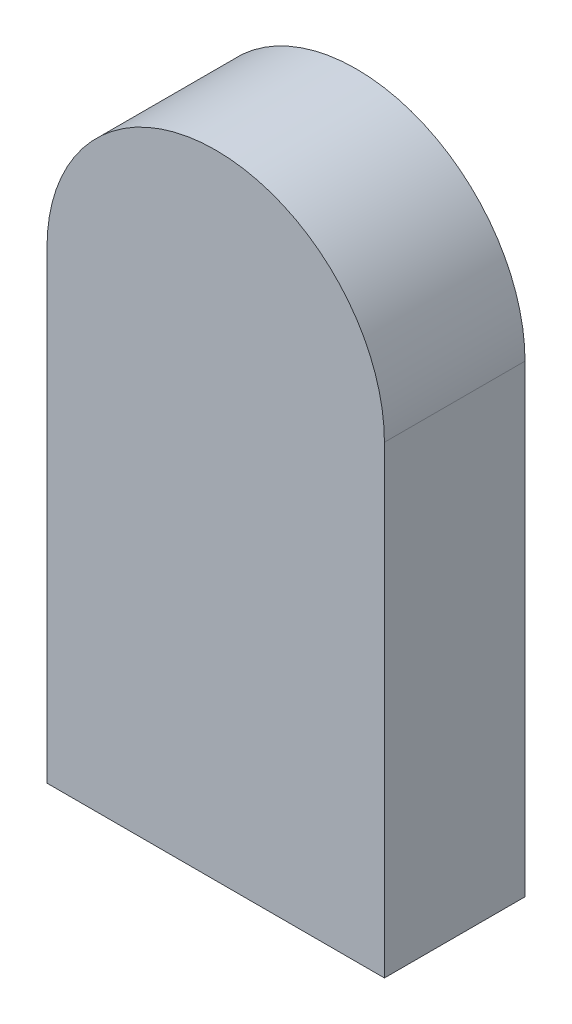
ISO-10303-21;
HEADER;
FILE_DESCRIPTION(('STEP AP214'),'2;1');
FILE_NAME('part.step','',(''),(''),'','','');
FILE_SCHEMA(('AUTOMOTIVE_DESIGN { 1 0 10303 214 1 1 1 1 }'));
ENDSEC;
DATA;
#1=APPLICATION_CONTEXT('core data for automotive mechanical design processes');
#2=APPLICATION_PROTOCOL_DEFINITION('international standard','automotive_design',2000,#1);
#3=PRODUCT_CONTEXT('',#1,'mechanical');
#4=PRODUCT('Part','Part','',(#3));
#5=PRODUCT_RELATED_PRODUCT_CATEGORY('part','',(#4));
#6=PRODUCT_DEFINITION_FORMATION('','',#4);
#7=PRODUCT_DEFINITION_CONTEXT('part definition',#1,'design');
#8=PRODUCT_DEFINITION('design','',#6,#7);
#9=PRODUCT_DEFINITION_SHAPE('','',#8);
#10=(LENGTH_UNIT() NAMED_UNIT(*) SI_UNIT(.MILLI.,.METRE.));
#11=(NAMED_UNIT(*) PLANE_ANGLE_UNIT() SI_UNIT($,.RADIAN.));
#12=(NAMED_UNIT(*) SI_UNIT($,.STERADIAN.) SOLID_ANGLE_UNIT());
#13=UNCERTAINTY_MEASURE_WITH_UNIT(LENGTH_MEASURE(1.E-05),#10,'distance_accuracy_value','');
#14=(GEOMETRIC_REPRESENTATION_CONTEXT(3) GLOBAL_UNCERTAINTY_ASSIGNED_CONTEXT((#13)) GLOBAL_UNIT_ASSIGNED_CONTEXT((#10,
#11,#12)) REPRESENTATION_CONTEXT('',''));
#15=CARTESIAN_POINT('',(0.,0.,0.));
#16=DIRECTION('',(0.,0.,1.));
#17=DIRECTION('',(1.,0.,0.));
#18=AXIS2_PLACEMENT_3D('',#15,#16,#17);
#19=CARTESIAN_POINT('',(-0.87,-4.05,0.));
#20=DIRECTION('',(0.,1.,0.));
#21=DIRECTION('',(1.,0.,0.));
#22=AXIS2_PLACEMENT_3D('',#19,#20,#21);
#23=PLANE('',#22);
#24=DIRECTION('',(1.,0.,0.));
#25=VECTOR('',#24,1.);
#26=CARTESIAN_POINT('',(-0.87,-4.05,0.));
#27=LINE('',#26,#25);
#28=CARTESIAN_POINT('',(-0.87,-4.05,0.));
#29=VERTEX_POINT('',#28);
#30=CARTESIAN_POINT('',(-0.63,-4.05,0.));
#31=VERTEX_POINT('',#30);
#32=EDGE_CURVE('E11',#29,#31,#27,.T.);
#33=ORIENTED_EDGE('',*,*,#32,.T.);
#34=DIRECTION('',(0.,0.,1.));
#35=VECTOR('',#34,1.);
#36=CARTESIAN_POINT('',(-0.63,-4.05,0.));
#37=LINE('',#36,#35);
#38=CARTESIAN_POINT('',(-0.63,-4.05,0.1));
#39=VERTEX_POINT('',#38);
#40=EDGE_CURVE('E24',#31,#39,#37,.T.);
#41=ORIENTED_EDGE('',*,*,#40,.T.);
#42=DIRECTION('',(1.,0.,0.));
#43=VECTOR('',#42,1.);
#44=CARTESIAN_POINT('',(-0.87,-4.05,0.1));
#45=LINE('',#44,#43);
#46=CARTESIAN_POINT('',(-0.87,-4.05,0.1));
#47=VERTEX_POINT('',#46);
#48=EDGE_CURVE('E87',#47,#39,#45,.T.);
#49=ORIENTED_EDGE('',*,*,#48,.F.);
#50=DIRECTION('',(0.,0.,1.));
#51=VECTOR('',#50,1.);
#52=CARTESIAN_POINT('',(-0.87,-4.05,0.));
#53=LINE('',#52,#51);
#54=EDGE_CURVE('E36',#29,#47,#53,.T.);
#55=ORIENTED_EDGE('',*,*,#54,.F.);
#56=EDGE_LOOP('',(#33,#41,#49,#55));
#57=FACE_BOUND('',#56,.T.);
#58=ADVANCED_FACE('F17',(#57),#23,.F.);
#59=CARTESIAN_POINT('',(-0.63,-4.05,0.));
#60=DIRECTION('',(-1.,0.,0.));
#61=DIRECTION('',(0.,1.,0.));
#62=AXIS2_PLACEMENT_3D('',#59,#60,#61);
#63=PLANE('',#62);
#64=DIRECTION('',(0.,1.,0.));
#65=VECTOR('',#64,1.);
#66=CARTESIAN_POINT('',(-0.63,-4.05,0.));
#67=LINE('',#66,#65);
#68=CARTESIAN_POINT('',(-0.63,-3.72,0.));
#69=VERTEX_POINT('',#68);
#70=EDGE_CURVE('E84',#31,#69,#67,.T.);
#71=ORIENTED_EDGE('',*,*,#70,.T.);
#72=DIRECTION('',(0.,0.,1.));
#73=VECTOR('',#72,1.);
#74=CARTESIAN_POINT('',(-0.63,-3.72,0.));
#75=LINE('',#74,#73);
#76=CARTESIAN_POINT('',(-0.63,-3.72,0.1));
#77=VERTEX_POINT('',#76);
#78=EDGE_CURVE('E82',#69,#77,#75,.T.);
#79=ORIENTED_EDGE('',*,*,#78,.T.);
#80=DIRECTION('',(0.,1.,0.));
#81=VECTOR('',#80,1.);
#82=CARTESIAN_POINT('',(-0.63,-4.05,0.1));
#83=LINE('',#82,#81);
#84=EDGE_CURVE('E72',#39,#77,#83,.T.);
#85=ORIENTED_EDGE('',*,*,#84,.F.);
#86=ORIENTED_EDGE('',*,*,#40,.F.);
#87=EDGE_LOOP('',(#71,#79,#85,#86));
#88=FACE_BOUND('',#87,.T.);
#89=ADVANCED_FACE('F89',(#88),#63,.F.);
#90=CARTESIAN_POINT('',(-0.75,-3.72,0.));
#91=DIRECTION('',(0.,0.,-1.));
#92=DIRECTION('',(1.,0.,0.));
#93=AXIS2_PLACEMENT_3D('',#90,#91,#92);
#94=CYLINDRICAL_SURFACE('',#93,0.12);
#95=CARTESIAN_POINT('',(-0.75,-3.72,0.));
#96=DIRECTION('',(0.,0.,1.));
#97=DIRECTION('',(1.,0.,0.));
#98=AXIS2_PLACEMENT_3D('',#95,#96,#97);
#99=CIRCLE('',#98,0.12);
#100=CARTESIAN_POINT('',(-0.87,-3.72,0.));
#101=VERTEX_POINT('',#100);
#102=EDGE_CURVE('E62',#69,#101,#99,.T.);
#103=ORIENTED_EDGE('',*,*,#102,.T.);
#104=DIRECTION('',(0.,0.,1.));
#105=VECTOR('',#104,1.);
#106=CARTESIAN_POINT('',(-0.87,-3.72,0.));
#107=LINE('',#106,#105);
#108=CARTESIAN_POINT('',(-0.87,-3.72,0.1));
#109=VERTEX_POINT('',#108);
#110=EDGE_CURVE('E57',#101,#109,#107,.T.);
#111=ORIENTED_EDGE('',*,*,#110,.T.);
#112=CARTESIAN_POINT('',(-0.75,-3.72,0.1));
#113=DIRECTION('',(0.,0.,1.));
#114=DIRECTION('',(1.,0.,0.));
#115=AXIS2_PLACEMENT_3D('',#112,#113,#114);
#116=CIRCLE('',#115,0.12);
#117=EDGE_CURVE('E60',#77,#109,#116,.T.);
#118=ORIENTED_EDGE('',*,*,#117,.F.);
#119=ORIENTED_EDGE('',*,*,#78,.F.);
#120=EDGE_LOOP('',(#103,#111,#118,#119));
#121=FACE_BOUND('',#120,.T.);
#122=ADVANCED_FACE('F59',(#121),#94,.T.);
#123=CARTESIAN_POINT('',(-0.87,-4.05,0.));
#124=DIRECTION('',(-1.,0.,0.));
#125=DIRECTION('',(0.,1.,0.));
#126=AXIS2_PLACEMENT_3D('',#123,#124,#125);
#127=PLANE('',#126);
#128=ORIENTED_EDGE('',*,*,#54,.T.);
#129=DIRECTION('',(0.,1.,0.));
#130=VECTOR('',#129,1.);
#131=CARTESIAN_POINT('',(-0.87,-4.05,0.1));
#132=LINE('',#131,#130);
#133=EDGE_CURVE('E71',#47,#109,#132,.T.);
#134=ORIENTED_EDGE('',*,*,#133,.T.);
#135=ORIENTED_EDGE('',*,*,#110,.F.);
#136=DIRECTION('',(0.,1.,0.));
#137=VECTOR('',#136,1.);
#138=CARTESIAN_POINT('',(-0.87,-4.05,0.));
#139=LINE('',#138,#137);
#140=EDGE_CURVE('E76',#29,#101,#139,.T.);
#141=ORIENTED_EDGE('',*,*,#140,.F.);
#142=EDGE_LOOP('',(#128,#134,#135,#141));
#143=FACE_BOUND('',#142,.T.);
#144=ADVANCED_FACE('F75',(#143),#127,.T.);
#145=CARTESIAN_POINT('',(-0.75,-3.849490847913,0.));
#146=DIRECTION('',(0.,0.,1.));
#147=DIRECTION('',(1.,0.,0.));
#148=AXIS2_PLACEMENT_3D('',#145,#146,#147);
#149=PLANE('',#148);
#150=ORIENTED_EDGE('',*,*,#140,.T.);
#151=ORIENTED_EDGE('',*,*,#102,.F.);
#152=ORIENTED_EDGE('',*,*,#70,.F.);
#153=ORIENTED_EDGE('',*,*,#32,.F.);
#154=EDGE_LOOP('',(#150,#151,#152,#153));
#155=FACE_BOUND('',#154,.T.);
#156=ADVANCED_FACE('F91',(#155),#149,.F.);
#157=CARTESIAN_POINT('',(-0.75,-3.849490847913,0.1));
#158=DIRECTION('',(0.,0.,1.));
#159=DIRECTION('',(1.,0.,0.));
#160=AXIS2_PLACEMENT_3D('',#157,#158,#159);
#161=PLANE('',#160);
#162=ORIENTED_EDGE('',*,*,#48,.T.);
#163=ORIENTED_EDGE('',*,*,#84,.T.);
#164=ORIENTED_EDGE('',*,*,#117,.T.);
#165=ORIENTED_EDGE('',*,*,#133,.F.);
#166=EDGE_LOOP('',(#162,#163,#164,#165));
#167=FACE_BOUND('',#166,.T.);
#168=ADVANCED_FACE('F70',(#167),#161,.T.);
#169=CLOSED_SHELL('',(#58,#89,#122,#144,#156,#168));
#170=MANIFOLD_SOLID_BREP('B1',#169);
#171=ADVANCED_BREP_SHAPE_REPRESENTATION('',(#18,#170),#14);
#172=SHAPE_DEFINITION_REPRESENTATION(#9,#171);
ENDSEC;
END-ISO-10303-21;
